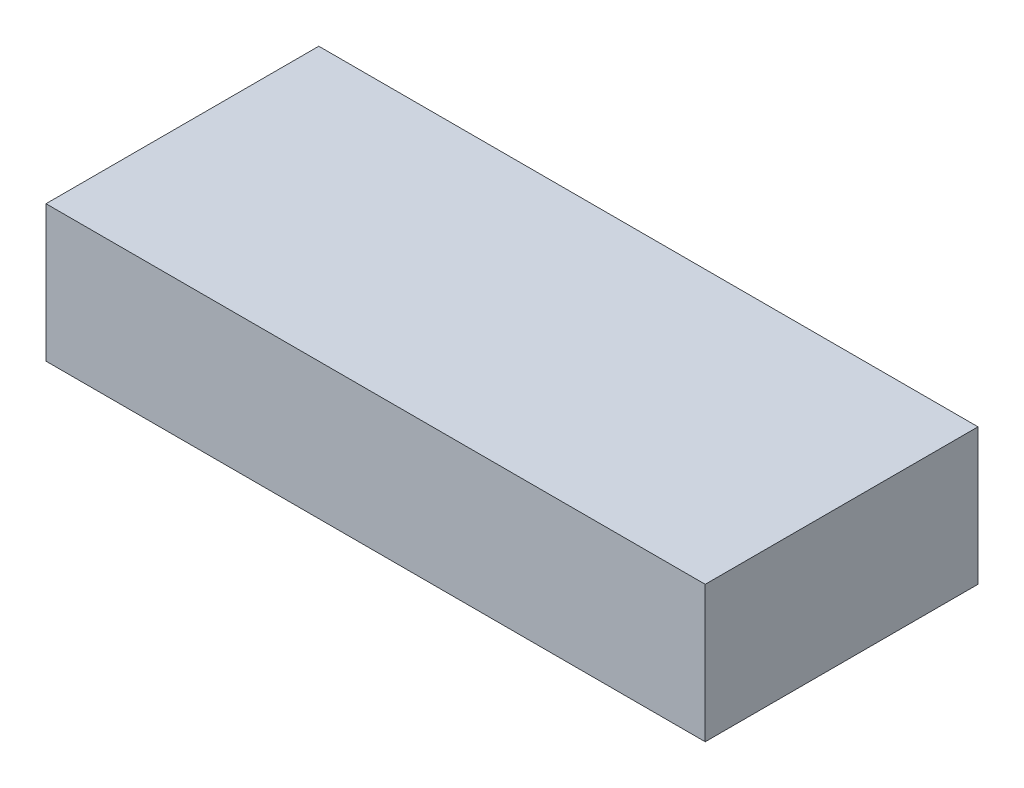
ISO-10303-21;
HEADER;
FILE_DESCRIPTION(('STEP AP214'),'2;1');
FILE_NAME('part.step','',(''),(''),'','','');
FILE_SCHEMA(('AUTOMOTIVE_DESIGN { 1 0 10303 214 1 1 1 1 }'));
ENDSEC;
DATA;
#1=APPLICATION_CONTEXT('core data for automotive mechanical design processes');
#2=APPLICATION_PROTOCOL_DEFINITION('international standard','automotive_design',2000,#1);
#3=PRODUCT_CONTEXT('',#1,'mechanical');
#4=PRODUCT('Part','Part','',(#3));
#5=PRODUCT_RELATED_PRODUCT_CATEGORY('part','',(#4));
#6=PRODUCT_DEFINITION_FORMATION('','',#4);
#7=PRODUCT_DEFINITION_CONTEXT('part definition',#1,'design');
#8=PRODUCT_DEFINITION('design','',#6,#7);
#9=PRODUCT_DEFINITION_SHAPE('','',#8);
#10=(LENGTH_UNIT() NAMED_UNIT(*) SI_UNIT(.MILLI.,.METRE.));
#11=(NAMED_UNIT(*) PLANE_ANGLE_UNIT() SI_UNIT($,.RADIAN.));
#12=(NAMED_UNIT(*) SI_UNIT($,.STERADIAN.) SOLID_ANGLE_UNIT());
#13=UNCERTAINTY_MEASURE_WITH_UNIT(LENGTH_MEASURE(1.E-05),#10,'distance_accuracy_value','');
#14=(GEOMETRIC_REPRESENTATION_CONTEXT(3) GLOBAL_UNCERTAINTY_ASSIGNED_CONTEXT((#13)) GLOBAL_UNIT_ASSIGNED_CONTEXT((#10,
#11,#12)) REPRESENTATION_CONTEXT('',''));
#15=CARTESIAN_POINT('',(0.,0.,0.));
#16=DIRECTION('',(0.,0.,1.));
#17=DIRECTION('',(1.,0.,0.));
#18=AXIS2_PLACEMENT_3D('',#15,#16,#17);
#19=CARTESIAN_POINT('',(0.,19.05,0.));
#20=DIRECTION('',(1.,0.,0.));
#21=DIRECTION('',(0.,0.,-1.));
#22=AXIS2_PLACEMENT_3D('',#19,#20,#21);
#23=PLANE('',#22);
#24=DIRECTION('',(0.,0.,1.));
#25=VECTOR('',#24,1.);
#26=CARTESIAN_POINT('',(0.,0.,0.));
#27=LINE('',#26,#25);
#28=CARTESIAN_POINT('',(0.,0.,-38.1));
#29=VERTEX_POINT('',#28);
#30=CARTESIAN_POINT('',(0.,0.,0.));
#31=VERTEX_POINT('',#30);
#32=EDGE_CURVE('E104',#29,#31,#27,.T.);
#33=ORIENTED_EDGE('',*,*,#32,.T.);
#34=DIRECTION('',(0.,-1.,0.));
#35=VECTOR('',#34,1.);
#36=CARTESIAN_POINT('',(0.,19.05,0.));
#37=LINE('',#36,#35);
#38=CARTESIAN_POINT('',(0.,19.05,0.));
#39=VERTEX_POINT('',#38);
#40=EDGE_CURVE('E11',#39,#31,#37,.T.);
#41=ORIENTED_EDGE('',*,*,#40,.F.);
#42=DIRECTION('',(0.,0.,1.));
#43=VECTOR('',#42,1.);
#44=CARTESIAN_POINT('',(0.,19.05,0.));
#45=LINE('',#44,#43);
#46=CARTESIAN_POINT('',(0.,19.05,-38.1));
#47=VERTEX_POINT('',#46);
#48=EDGE_CURVE('E92',#47,#39,#45,.T.);
#49=ORIENTED_EDGE('',*,*,#48,.F.);
#50=DIRECTION('',(0.,-1.,0.));
#51=VECTOR('',#50,1.);
#52=CARTESIAN_POINT('',(0.,19.05,-38.1));
#53=LINE('',#52,#51);
#54=EDGE_CURVE('E100',#47,#29,#53,.T.);
#55=ORIENTED_EDGE('',*,*,#54,.T.);
#56=EDGE_LOOP('',(#33,#41,#49,#55));
#57=FACE_BOUND('',#56,.T.);
#58=ADVANCED_FACE('F41',(#57),#23,.F.);
#59=CARTESIAN_POINT('',(0.,19.05,0.));
#60=DIRECTION('',(0.,0.,-1.));
#61=DIRECTION('',(-1.,0.,0.));
#62=AXIS2_PLACEMENT_3D('',#59,#60,#61);
#63=PLANE('',#62);
#64=DIRECTION('',(1.,0.,0.));
#65=VECTOR('',#64,1.);
#66=CARTESIAN_POINT('',(0.,0.,0.));
#67=LINE('',#66,#65);
#68=CARTESIAN_POINT('',(92.075,0.,0.));
#69=VERTEX_POINT('',#68);
#70=EDGE_CURVE('E96',#31,#69,#67,.T.);
#71=ORIENTED_EDGE('',*,*,#70,.T.);
#72=DIRECTION('',(0.,-1.,0.));
#73=VECTOR('',#72,1.);
#74=CARTESIAN_POINT('',(92.075,19.05,0.));
#75=LINE('',#74,#73);
#76=CARTESIAN_POINT('',(92.075,19.05,0.));
#77=VERTEX_POINT('',#76);
#78=EDGE_CURVE('E49',#77,#69,#75,.T.);
#79=ORIENTED_EDGE('',*,*,#78,.F.);
#80=DIRECTION('',(1.,0.,0.));
#81=VECTOR('',#80,1.);
#82=CARTESIAN_POINT('',(0.,19.05,0.));
#83=LINE('',#82,#81);
#84=EDGE_CURVE('E87',#39,#77,#83,.T.);
#85=ORIENTED_EDGE('',*,*,#84,.F.);
#86=ORIENTED_EDGE('',*,*,#40,.T.);
#87=EDGE_LOOP('',(#71,#79,#85,#86));
#88=FACE_BOUND('',#87,.T.);
#89=ADVANCED_FACE('F95',(#88),#63,.F.);
#90=CARTESIAN_POINT('',(92.075,19.05,0.));
#91=DIRECTION('',(-1.,0.,0.));
#92=DIRECTION('',(0.,0.,1.));
#93=AXIS2_PLACEMENT_3D('',#90,#91,#92);
#94=PLANE('',#93);
#95=DIRECTION('',(0.,0.,-1.));
#96=VECTOR('',#95,1.);
#97=CARTESIAN_POINT('',(92.075,0.,0.));
#98=LINE('',#97,#96);
#99=CARTESIAN_POINT('',(92.075,0.,-38.1));
#100=VERTEX_POINT('',#99);
#101=EDGE_CURVE('E74',#69,#100,#98,.T.);
#102=ORIENTED_EDGE('',*,*,#101,.T.);
#103=DIRECTION('',(0.,-1.,0.));
#104=VECTOR('',#103,1.);
#105=CARTESIAN_POINT('',(92.075,19.05,-38.1));
#106=LINE('',#105,#104);
#107=CARTESIAN_POINT('',(92.075,19.05,-38.1));
#108=VERTEX_POINT('',#107);
#109=EDGE_CURVE('E97',#108,#100,#106,.T.);
#110=ORIENTED_EDGE('',*,*,#109,.F.);
#111=DIRECTION('',(0.,0.,-1.));
#112=VECTOR('',#111,1.);
#113=CARTESIAN_POINT('',(92.075,19.05,0.));
#114=LINE('',#113,#112);
#115=EDGE_CURVE('E90',#77,#108,#114,.T.);
#116=ORIENTED_EDGE('',*,*,#115,.F.);
#117=ORIENTED_EDGE('',*,*,#78,.T.);
#118=EDGE_LOOP('',(#102,#110,#116,#117));
#119=FACE_BOUND('',#118,.T.);
#120=ADVANCED_FACE('F98',(#119),#94,.F.);
#121=CARTESIAN_POINT('',(0.,19.05,-38.1));
#122=DIRECTION('',(0.,0.,1.));
#123=DIRECTION('',(1.,0.,0.));
#124=AXIS2_PLACEMENT_3D('',#121,#122,#123);
#125=PLANE('',#124);
#126=DIRECTION('',(-1.,0.,0.));
#127=VECTOR('',#126,1.);
#128=CARTESIAN_POINT('',(0.,0.,-38.1));
#129=LINE('',#128,#127);
#130=EDGE_CURVE('E80',#100,#29,#129,.T.);
#131=ORIENTED_EDGE('',*,*,#130,.T.);
#132=ORIENTED_EDGE('',*,*,#54,.F.);
#133=DIRECTION('',(-1.,0.,0.));
#134=VECTOR('',#133,1.);
#135=CARTESIAN_POINT('',(0.,19.05,-38.1));
#136=LINE('',#135,#134);
#137=EDGE_CURVE('E57',#108,#47,#136,.T.);
#138=ORIENTED_EDGE('',*,*,#137,.F.);
#139=ORIENTED_EDGE('',*,*,#109,.T.);
#140=EDGE_LOOP('',(#131,#132,#138,#139));
#141=FACE_BOUND('',#140,.T.);
#142=ADVANCED_FACE('F111',(#141),#125,.F.);
#143=CARTESIAN_POINT('',(0.,19.05,0.));
#144=DIRECTION('',(0.,-1.,0.));
#145=DIRECTION('',(0.,0.,-1.));
#146=AXIS2_PLACEMENT_3D('',#143,#144,#145);
#147=PLANE('',#146);
#148=ORIENTED_EDGE('',*,*,#48,.T.);
#149=ORIENTED_EDGE('',*,*,#84,.T.);
#150=ORIENTED_EDGE('',*,*,#115,.T.);
#151=ORIENTED_EDGE('',*,*,#137,.T.);
#152=EDGE_LOOP('',(#148,#149,#150,#151));
#153=FACE_BOUND('',#152,.T.);
#154=ADVANCED_FACE('F88',(#153),#147,.F.);
#155=CARTESIAN_POINT('',(0.,0.,0.));
#156=DIRECTION('',(0.,-1.,0.));
#157=DIRECTION('',(0.,0.,-1.));
#158=AXIS2_PLACEMENT_3D('',#155,#156,#157);
#159=PLANE('',#158);
#160=ORIENTED_EDGE('',*,*,#32,.F.);
#161=ORIENTED_EDGE('',*,*,#130,.F.);
#162=ORIENTED_EDGE('',*,*,#101,.F.);
#163=ORIENTED_EDGE('',*,*,#70,.F.);
#164=EDGE_LOOP('',(#160,#161,#162,#163));
#165=FACE_BOUND('',#164,.T.);
#166=ADVANCED_FACE('F114',(#165),#159,.T.);
#167=CLOSED_SHELL('',(#58,#89,#120,#142,#154,#166));
#168=MANIFOLD_SOLID_BREP('B2',#167);
#169=ADVANCED_BREP_SHAPE_REPRESENTATION('',(#18,#168),#14);
#170=SHAPE_DEFINITION_REPRESENTATION(#9,#169);
ENDSEC;
END-ISO-10303-21;
